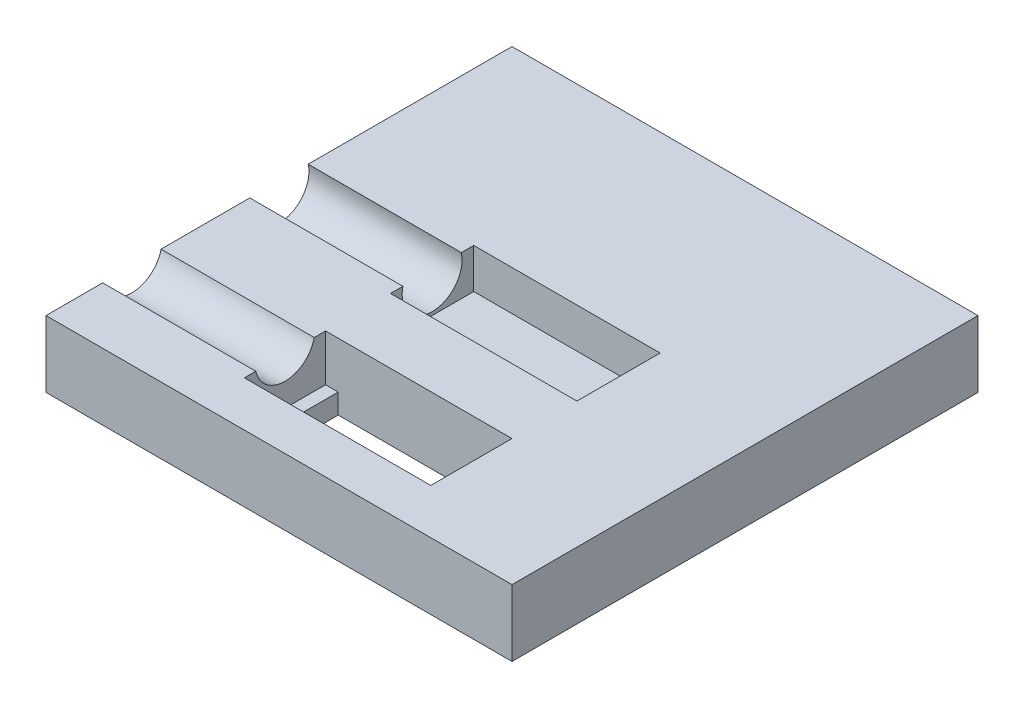
ISO-10303-21;
HEADER;
FILE_DESCRIPTION(('STEP AP214'),'2;1');
FILE_NAME('part.step','',(''),(''),'','','');
FILE_SCHEMA(('AUTOMOTIVE_DESIGN { 1 0 10303 214 1 1 1 1 }'));
ENDSEC;
DATA;
#1=APPLICATION_CONTEXT('core data for automotive mechanical design processes');
#2=APPLICATION_PROTOCOL_DEFINITION('international standard','automotive_design',2000,#1);
#3=PRODUCT_CONTEXT('',#1,'mechanical');
#4=PRODUCT('Part','Part','',(#3));
#5=PRODUCT_RELATED_PRODUCT_CATEGORY('part','',(#4));
#6=PRODUCT_DEFINITION_FORMATION('','',#4);
#7=PRODUCT_DEFINITION_CONTEXT('part definition',#1,'design');
#8=PRODUCT_DEFINITION('design','',#6,#7);
#9=PRODUCT_DEFINITION_SHAPE('','',#8);
#10=(LENGTH_UNIT() NAMED_UNIT(*) SI_UNIT(.MILLI.,.METRE.));
#11=(NAMED_UNIT(*) PLANE_ANGLE_UNIT() SI_UNIT($,.RADIAN.));
#12=(NAMED_UNIT(*) SI_UNIT($,.STERADIAN.) SOLID_ANGLE_UNIT());
#13=UNCERTAINTY_MEASURE_WITH_UNIT(LENGTH_MEASURE(1.E-05),#10,'distance_accuracy_value','');
#14=(GEOMETRIC_REPRESENTATION_CONTEXT(3) GLOBAL_UNCERTAINTY_ASSIGNED_CONTEXT((#13)) GLOBAL_UNIT_ASSIGNED_CONTEXT((#10,
#11,#12)) REPRESENTATION_CONTEXT('',''));
#15=CARTESIAN_POINT('',(0.,0.,0.));
#16=DIRECTION('',(0.,0.,1.));
#17=DIRECTION('',(1.,0.,0.));
#18=AXIS2_PLACEMENT_3D('',#15,#16,#17);
#19=CARTESIAN_POINT('',(-35.001,46.,22.1));
#20=DIRECTION('',(1.,0.,0.));
#21=DIRECTION('',(0.,0.,-1.));
#22=AXIS2_PLACEMENT_3D('',#19,#20,#21);
#23=CYLINDRICAL_SURFACE('',#22,4.50000000000001);
#24=CARTESIAN_POINT('',(-12.,46.,22.1));
#25=DIRECTION('',(1.,0.,0.));
#26=DIRECTION('',(0.,0.,-1.));
#27=AXIS2_PLACEMENT_3D('',#24,#25,#26);
#28=CIRCLE('',#27,4.50000000000001);
#29=CARTESIAN_POINT('',(-12.,45.0001693639848,17.7124792081079));
#30=VERTEX_POINT('',#29);
#31=CARTESIAN_POINT('',(-12.,45.0001693639848,26.4875207918921));
#32=VERTEX_POINT('',#31);
#33=EDGE_CURVE('E190',#30,#32,#28,.F.);
#34=ORIENTED_EDGE('',*,*,#33,.F.);
#35=DIRECTION('',(1.,0.,0.));
#36=VECTOR('',#35,1.);
#37=CARTESIAN_POINT('',(-35.001,45.0001693639848,17.7124792081079));
#38=LINE('',#37,#36);
#39=CARTESIAN_POINT('',(-35.,45.0001693639848,17.7124792081079));
#40=VERTEX_POINT('',#39);
#41=EDGE_CURVE('E65',#40,#30,#38,.T.);
#42=ORIENTED_EDGE('',*,*,#41,.F.);
#43=CARTESIAN_POINT('',(-35.,46.,22.1));
#44=DIRECTION('',(1.,0.,0.));
#45=DIRECTION('',(0.,0.,-1.));
#46=AXIS2_PLACEMENT_3D('',#43,#44,#45);
#47=CIRCLE('',#46,4.50000000000001);
#48=CARTESIAN_POINT('',(-35.,45.0001693639848,26.4875207918921));
#49=VERTEX_POINT('',#48);
#50=EDGE_CURVE('E255',#40,#49,#47,.F.);
#51=ORIENTED_EDGE('',*,*,#50,.T.);
#52=DIRECTION('',(1.,0.,0.));
#53=VECTOR('',#52,1.);
#54=CARTESIAN_POINT('',(-35.001,45.0001693639848,26.4875207918921));
#55=LINE('',#54,#53);
#56=EDGE_CURVE('E358',#32,#49,#55,.F.);
#57=ORIENTED_EDGE('',*,*,#56,.F.);
#58=EDGE_LOOP('',(#34,#42,#51,#57));
#59=FACE_BOUND('',#58,.T.);
#60=ADVANCED_FACE('F41',(#59),#23,.F.);
#61=CARTESIAN_POINT('',(-35.001,44.,0.));
#62=DIRECTION('',(1.,0.,0.));
#63=DIRECTION('',(0.,0.,-1.));
#64=AXIS2_PLACEMENT_3D('',#61,#62,#63);
#65=CYLINDRICAL_SURFACE('',#64,4.5);
#66=CARTESIAN_POINT('',(-12.,44.,0.));
#67=DIRECTION('',(1.,0.,0.));
#68=DIRECTION('',(0.,0.,-1.));
#69=AXIS2_PLACEMENT_3D('',#66,#67,#68);
#70=CIRCLE('',#69,4.5);
#71=CARTESIAN_POINT('',(-12.,45.0001693639848,-4.38744358862267));
#72=VERTEX_POINT('',#71);
#73=CARTESIAN_POINT('',(-12.,45.0001693639848,4.38744358862267));
#74=VERTEX_POINT('',#73);
#75=EDGE_CURVE('E246',#72,#74,#70,.F.);
#76=ORIENTED_EDGE('',*,*,#75,.F.);
#77=DIRECTION('',(1.,0.,0.));
#78=VECTOR('',#77,1.);
#79=CARTESIAN_POINT('',(-35.001,45.0001693639848,-4.38744358862266));
#80=LINE('',#79,#78);
#81=CARTESIAN_POINT('',(-35.,45.0001693639848,-4.38744358862266));
#82=VERTEX_POINT('',#81);
#83=EDGE_CURVE('E313',#82,#72,#80,.T.);
#84=ORIENTED_EDGE('',*,*,#83,.F.);
#85=CARTESIAN_POINT('',(-35.,44.,0.));
#86=DIRECTION('',(1.,0.,0.));
#87=DIRECTION('',(0.,0.,-1.));
#88=AXIS2_PLACEMENT_3D('',#85,#86,#87);
#89=CIRCLE('',#88,4.5);
#90=CARTESIAN_POINT('',(-35.,45.0001693639848,4.38744358862267));
#91=VERTEX_POINT('',#90);
#92=EDGE_CURVE('E263',#82,#91,#89,.F.);
#93=ORIENTED_EDGE('',*,*,#92,.T.);
#94=DIRECTION('',(1.,0.,0.));
#95=VECTOR('',#94,1.);
#96=CARTESIAN_POINT('',(-35.001,45.0001693639848,4.38744358862267));
#97=LINE('',#96,#95);
#98=EDGE_CURVE('E315',#74,#91,#97,.F.);
#99=ORIENTED_EDGE('',*,*,#98,.F.);
#100=EDGE_LOOP('',(#76,#84,#93,#99));
#101=FACE_BOUND('',#100,.T.);
#102=ADVANCED_FACE('F312',(#101),#65,.F.);
#103=CARTESIAN_POINT('',(35.,64.,-35.));
#104=DIRECTION('',(-1.,0.,0.));
#105=DIRECTION('',(0.,0.,1.));
#106=AXIS2_PLACEMENT_3D('',#103,#104,#105);
#107=PLANE('',#106);
#108=DIRECTION('',(0.,-1.,0.));
#109=VECTOR('',#108,1.);
#110=CARTESIAN_POINT('',(35.,64.,-35.));
#111=LINE('',#110,#109);
#112=CARTESIAN_POINT('',(35.,45.0001693639848,-35.));
#113=VERTEX_POINT('',#112);
#114=CARTESIAN_POINT('',(35.,35.0001693639848,-35.));
#115=VERTEX_POINT('',#114);
#116=EDGE_CURVE('E50',#113,#115,#111,.T.);
#117=ORIENTED_EDGE('',*,*,#116,.F.);
#118=DIRECTION('',(0.,0.,-1.));
#119=VECTOR('',#118,1.);
#120=CARTESIAN_POINT('',(35.,45.0001693639848,0.));
#121=LINE('',#120,#119);
#122=CARTESIAN_POINT('',(35.,45.0001693639848,35.));
#123=VERTEX_POINT('',#122);
#124=EDGE_CURVE('E352',#123,#113,#121,.T.);
#125=ORIENTED_EDGE('',*,*,#124,.F.);
#126=DIRECTION('',(0.,-1.,0.));
#127=VECTOR('',#126,1.);
#128=CARTESIAN_POINT('',(35.,64.,35.));
#129=LINE('',#128,#127);
#130=CARTESIAN_POINT('',(35.,35.0001693639848,35.));
#131=VERTEX_POINT('',#130);
#132=EDGE_CURVE('E285',#123,#131,#129,.T.);
#133=ORIENTED_EDGE('',*,*,#132,.T.);
#134=DIRECTION('',(0.,0.,1.));
#135=VECTOR('',#134,1.);
#136=CARTESIAN_POINT('',(35.,35.0001693639848,35.));
#137=LINE('',#136,#135);
#138=EDGE_CURVE('E204',#115,#131,#137,.T.);
#139=ORIENTED_EDGE('',*,*,#138,.F.);
#140=EDGE_LOOP('',(#117,#125,#133,#139));
#141=FACE_BOUND('',#140,.T.);
#142=ADVANCED_FACE('F43',(#141),#107,.F.);
#143=CARTESIAN_POINT('',(-35.,64.,-35.));
#144=DIRECTION('',(0.,0.,1.));
#145=DIRECTION('',(1.,0.,0.));
#146=AXIS2_PLACEMENT_3D('',#143,#144,#145);
#147=PLANE('',#146);
#148=DIRECTION('',(0.,-1.,0.));
#149=VECTOR('',#148,1.);
#150=CARTESIAN_POINT('',(-35.,64.,-35.));
#151=LINE('',#150,#149);
#152=CARTESIAN_POINT('',(-35.,45.0001693639848,-35.));
#153=VERTEX_POINT('',#152);
#154=CARTESIAN_POINT('',(-35.,35.0001693639848,-35.));
#155=VERTEX_POINT('',#154);
#156=EDGE_CURVE('E294',#153,#155,#151,.T.);
#157=ORIENTED_EDGE('',*,*,#156,.F.);
#158=DIRECTION('',(-1.,0.,0.));
#159=VECTOR('',#158,1.);
#160=CARTESIAN_POINT('',(0.,45.0001693639848,-35.));
#161=LINE('',#160,#159);
#162=EDGE_CURVE('E351',#113,#153,#161,.T.);
#163=ORIENTED_EDGE('',*,*,#162,.F.);
#164=ORIENTED_EDGE('',*,*,#116,.T.);
#165=DIRECTION('',(1.,0.,0.));
#166=VECTOR('',#165,1.);
#167=CARTESIAN_POINT('',(-35.001,35.0001693639848,-35.));
#168=LINE('',#167,#166);
#169=EDGE_CURVE('E208',#155,#115,#168,.T.);
#170=ORIENTED_EDGE('',*,*,#169,.F.);
#171=EDGE_LOOP('',(#157,#163,#164,#170));
#172=FACE_BOUND('',#171,.T.);
#173=ADVANCED_FACE('F402',(#172),#147,.F.);
#174=CARTESIAN_POINT('',(-35.,64.,-35.));
#175=DIRECTION('',(1.,0.,0.));
#176=DIRECTION('',(0.,0.,-1.));
#177=AXIS2_PLACEMENT_3D('',#174,#175,#176);
#178=PLANE('',#177);
#179=DIRECTION('',(0.,-1.,0.));
#180=VECTOR('',#179,1.);
#181=CARTESIAN_POINT('',(-35.,64.,35.));
#182=LINE('',#181,#180);
#183=CARTESIAN_POINT('',(-35.,45.0001693639848,35.));
#184=VERTEX_POINT('',#183);
#185=CARTESIAN_POINT('',(-35.,35.0001693639848,35.));
#186=VERTEX_POINT('',#185);
#187=EDGE_CURVE('E291',#184,#186,#182,.T.);
#188=ORIENTED_EDGE('',*,*,#187,.F.);
#189=DIRECTION('',(0.,0.,1.));
#190=VECTOR('',#189,1.);
#191=CARTESIAN_POINT('',(-35.,45.0001693639848,0.));
#192=LINE('',#191,#190);
#193=EDGE_CURVE('E325',#49,#184,#192,.T.);
#194=ORIENTED_EDGE('',*,*,#193,.F.);
#195=ORIENTED_EDGE('',*,*,#50,.F.);
#196=EDGE_CURVE('E323',#91,#40,#192,.T.);
#197=ORIENTED_EDGE('',*,*,#196,.F.);
#198=ORIENTED_EDGE('',*,*,#92,.F.);
#199=EDGE_CURVE('E318',#153,#82,#192,.T.);
#200=ORIENTED_EDGE('',*,*,#199,.F.);
#201=ORIENTED_EDGE('',*,*,#156,.T.);
#202=DIRECTION('',(0.,0.,-1.));
#203=VECTOR('',#202,1.);
#204=CARTESIAN_POINT('',(-35.,35.0001693639848,35.));
#205=LINE('',#204,#203);
#206=EDGE_CURVE('E195',#186,#155,#205,.T.);
#207=ORIENTED_EDGE('',*,*,#206,.F.);
#208=EDGE_LOOP('',(#188,#194,#195,#197,#198,#200,#201,#207));
#209=FACE_BOUND('',#208,.T.);
#210=ADVANCED_FACE('F385',(#209),#178,.F.);
#211=CARTESIAN_POINT('',(-35.,64.,35.));
#212=DIRECTION('',(0.,0.,-1.));
#213=DIRECTION('',(-1.,0.,0.));
#214=AXIS2_PLACEMENT_3D('',#211,#212,#213);
#215=PLANE('',#214);
#216=ORIENTED_EDGE('',*,*,#132,.F.);
#217=DIRECTION('',(1.,0.,0.));
#218=VECTOR('',#217,1.);
#219=CARTESIAN_POINT('',(0.,45.0001693639848,35.));
#220=LINE('',#219,#218);
#221=EDGE_CURVE('E373',#184,#123,#220,.T.);
#222=ORIENTED_EDGE('',*,*,#221,.F.);
#223=ORIENTED_EDGE('',*,*,#187,.T.);
#224=DIRECTION('',(1.,0.,0.));
#225=VECTOR('',#224,1.);
#226=CARTESIAN_POINT('',(-35.001,35.0001693639848,35.));
#227=LINE('',#226,#225);
#228=EDGE_CURVE('E209',#186,#131,#227,.T.);
#229=ORIENTED_EDGE('',*,*,#228,.T.);
#230=EDGE_LOOP('',(#216,#222,#223,#229));
#231=FACE_BOUND('',#230,.T.);
#232=ADVANCED_FACE('F391',(#231),#215,.F.);
#233=CARTESIAN_POINT('',(16.,39.,6.));
#234=DIRECTION('',(1.,0.,0.));
#235=DIRECTION('',(0.,0.,-1.));
#236=AXIS2_PLACEMENT_3D('',#233,#234,#235);
#237=PLANE('',#236);
#238=DIRECTION('',(0.,1.,0.));
#239=VECTOR('',#238,1.);
#240=CARTESIAN_POINT('',(16.,39.,6.25));
#241=LINE('',#240,#239);
#242=CARTESIAN_POINT('',(16.,39.,6.25));
#243=VERTEX_POINT('',#242);
#244=CARTESIAN_POINT('',(16.,45.0001693639848,6.25));
#245=VERTEX_POINT('',#244);
#246=EDGE_CURVE('E281',#243,#245,#241,.T.);
#247=ORIENTED_EDGE('',*,*,#246,.T.);
#248=DIRECTION('',(0.,0.,1.));
#249=VECTOR('',#248,1.);
#250=CARTESIAN_POINT('',(16.,45.0001693639848,0.));
#251=LINE('',#250,#249);
#252=CARTESIAN_POINT('',(16.,45.0001693639848,-6.25));
#253=VERTEX_POINT('',#252);
#254=EDGE_CURVE('E337',#253,#245,#251,.T.);
#255=ORIENTED_EDGE('',*,*,#254,.F.);
#256=DIRECTION('',(0.,1.,0.));
#257=VECTOR('',#256,1.);
#258=CARTESIAN_POINT('',(16.,39.,-6.25));
#259=LINE('',#258,#257);
#260=CARTESIAN_POINT('',(16.,39.,-6.25));
#261=VERTEX_POINT('',#260);
#262=EDGE_CURVE('E280',#261,#253,#259,.T.);
#263=ORIENTED_EDGE('',*,*,#262,.F.);
#264=DIRECTION('',(0.,0.,-1.));
#265=VECTOR('',#264,1.);
#266=CARTESIAN_POINT('',(16.,39.,-6.25));
#267=LINE('',#266,#265);
#268=EDGE_CURVE('E269',#243,#261,#267,.T.);
#269=ORIENTED_EDGE('',*,*,#268,.F.);
#270=EDGE_LOOP('',(#247,#255,#263,#269));
#271=FACE_BOUND('',#270,.T.);
#272=ADVANCED_FACE('F416',(#271),#237,.F.);
#273=CARTESIAN_POINT('',(16.,39.,6.25));
#274=DIRECTION('',(0.,0.,1.));
#275=DIRECTION('',(1.,0.,0.));
#276=AXIS2_PLACEMENT_3D('',#273,#274,#275);
#277=PLANE('',#276);
#278=DIRECTION('',(0.,-1.,0.));
#279=VECTOR('',#278,1.);
#280=CARTESIAN_POINT('',(-12.,51.9986853970522,6.25));
#281=LINE('',#280,#279);
#282=CARTESIAN_POINT('',(-12.,45.0001693639848,6.25));
#283=VERTEX_POINT('',#282);
#284=CARTESIAN_POINT('',(-12.,39.,6.25));
#285=VERTEX_POINT('',#284);
#286=EDGE_CURVE('E239',#283,#285,#281,.T.);
#287=ORIENTED_EDGE('',*,*,#286,.F.);
#288=DIRECTION('',(-1.,0.,0.));
#289=VECTOR('',#288,1.);
#290=CARTESIAN_POINT('',(0.,45.0001693639848,6.25));
#291=LINE('',#290,#289);
#292=EDGE_CURVE('E334',#245,#283,#291,.T.);
#293=ORIENTED_EDGE('',*,*,#292,.F.);
#294=ORIENTED_EDGE('',*,*,#246,.F.);
#295=DIRECTION('',(1.,0.,0.));
#296=VECTOR('',#295,1.);
#297=CARTESIAN_POINT('',(16.,39.,6.25));
#298=LINE('',#297,#296);
#299=EDGE_CURVE('E276',#285,#243,#298,.T.);
#300=ORIENTED_EDGE('',*,*,#299,.F.);
#301=EDGE_LOOP('',(#287,#293,#294,#300));
#302=FACE_BOUND('',#301,.T.);
#303=ADVANCED_FACE('F419',(#302),#277,.F.);
#304=CARTESIAN_POINT('',(-7.,39.,-6.25));
#305=DIRECTION('',(0.,0.,-1.));
#306=DIRECTION('',(-1.,0.,0.));
#307=AXIS2_PLACEMENT_3D('',#304,#305,#306);
#308=PLANE('',#307);
#309=ORIENTED_EDGE('',*,*,#262,.T.);
#310=DIRECTION('',(1.,0.,0.));
#311=VECTOR('',#310,1.);
#312=CARTESIAN_POINT('',(0.,45.0001693639848,-6.25));
#313=LINE('',#312,#311);
#314=CARTESIAN_POINT('',(-12.,45.0001693639848,-6.25));
#315=VERTEX_POINT('',#314);
#316=EDGE_CURVE('E331',#315,#253,#313,.T.);
#317=ORIENTED_EDGE('',*,*,#316,.F.);
#318=DIRECTION('',(0.,1.,0.));
#319=VECTOR('',#318,1.);
#320=CARTESIAN_POINT('',(-12.,39.,-6.25));
#321=LINE('',#320,#319);
#322=CARTESIAN_POINT('',(-12.,39.,-6.25));
#323=VERTEX_POINT('',#322);
#324=EDGE_CURVE('E235',#323,#315,#321,.T.);
#325=ORIENTED_EDGE('',*,*,#324,.F.);
#326=DIRECTION('',(-1.,0.,0.));
#327=VECTOR('',#326,1.);
#328=CARTESIAN_POINT('',(-7.,39.,-6.25));
#329=LINE('',#328,#327);
#330=EDGE_CURVE('E273',#261,#323,#329,.T.);
#331=ORIENTED_EDGE('',*,*,#330,.F.);
#332=EDGE_LOOP('',(#309,#317,#325,#331));
#333=FACE_BOUND('',#332,.T.);
#334=ADVANCED_FACE('F408',(#333),#308,.F.);
#335=CARTESIAN_POINT('',(0.,39.,0.));
#336=DIRECTION('',(0.,-1.,0.));
#337=DIRECTION('',(0.,0.,-1.));
#338=AXIS2_PLACEMENT_3D('',#335,#336,#337);
#339=PLANE('',#338);
#340=ORIENTED_EDGE('',*,*,#268,.T.);
#341=ORIENTED_EDGE('',*,*,#330,.T.);
#342=DIRECTION('',(0.,0.,-1.));
#343=VECTOR('',#342,1.);
#344=CARTESIAN_POINT('',(-12.,39.,6.25));
#345=LINE('',#344,#343);
#346=EDGE_CURVE('E242',#285,#323,#345,.T.);
#347=ORIENTED_EDGE('',*,*,#346,.F.);
#348=ORIENTED_EDGE('',*,*,#299,.T.);
#349=EDGE_LOOP('',(#340,#341,#347,#348));
#350=FACE_BOUND('',#349,.T.);
#351=ADVANCED_FACE('F413',(#350),#339,.F.);
#352=CARTESIAN_POINT('',(-7.,51.,28.2));
#353=DIRECTION('',(0.,0.,1.));
#354=DIRECTION('',(1.,0.,0.));
#355=AXIS2_PLACEMENT_3D('',#352,#353,#354);
#356=PLANE('',#355);
#357=DIRECTION('',(1.,0.,0.));
#358=VECTOR('',#357,1.);
#359=CARTESIAN_POINT('',(-35.001,35.0001693639848,28.2));
#360=LINE('',#359,#358);
#361=CARTESIAN_POINT('',(-10.1,35.0001693639848,28.2));
#362=VERTEX_POINT('',#361);
#363=CARTESIAN_POINT('',(16.,35.0001693639848,28.2));
#364=VERTEX_POINT('',#363);
#365=EDGE_CURVE('E231',#362,#364,#360,.T.);
#366=ORIENTED_EDGE('',*,*,#365,.F.);
#367=DIRECTION('',(0.,1.,0.));
#368=VECTOR('',#367,1.);
#369=CARTESIAN_POINT('',(-10.1,34.9991693639848,28.2));
#370=LINE('',#369,#368);
#371=CARTESIAN_POINT('',(-10.1,38.0001693639849,28.2));
#372=VERTEX_POINT('',#371);
#373=EDGE_CURVE('E57',#362,#372,#370,.T.);
#374=ORIENTED_EDGE('',*,*,#373,.T.);
#375=DIRECTION('',(1.,0.,0.));
#376=VECTOR('',#375,1.);
#377=CARTESIAN_POINT('',(-12.,38.0001693639849,28.2));
#378=LINE('',#377,#376);
#379=CARTESIAN_POINT('',(-12.,38.0001693639849,28.2));
#380=VERTEX_POINT('',#379);
#381=EDGE_CURVE('E173',#380,#372,#378,.T.);
#382=ORIENTED_EDGE('',*,*,#381,.F.);
#383=DIRECTION('',(0.,-1.,0.));
#384=VECTOR('',#383,1.);
#385=CARTESIAN_POINT('',(-12.,51.,28.2));
#386=LINE('',#385,#384);
#387=CARTESIAN_POINT('',(-12.,45.0001693639848,28.2));
#388=VERTEX_POINT('',#387);
#389=EDGE_CURVE('E341',#388,#380,#386,.T.);
#390=ORIENTED_EDGE('',*,*,#389,.F.);
#391=DIRECTION('',(-1.,0.,0.));
#392=VECTOR('',#391,1.);
#393=CARTESIAN_POINT('',(0.,45.0001693639848,28.2));
#394=LINE('',#393,#392);
#395=CARTESIAN_POINT('',(16.,45.0001693639848,28.2));
#396=VERTEX_POINT('',#395);
#397=EDGE_CURVE('E362',#396,#388,#394,.T.);
#398=ORIENTED_EDGE('',*,*,#397,.F.);
#399=DIRECTION('',(0.,-1.,0.));
#400=VECTOR('',#399,1.);
#401=CARTESIAN_POINT('',(16.,51.,28.2));
#402=LINE('',#401,#400);
#403=EDGE_CURVE('E260',#396,#364,#402,.T.);
#404=ORIENTED_EDGE('',*,*,#403,.T.);
#405=EDGE_LOOP('',(#366,#374,#382,#390,#398,#404));
#406=FACE_BOUND('',#405,.T.);
#407=ADVANCED_FACE('F441',(#406),#356,.F.);
#408=CARTESIAN_POINT('',(16.,51.,16.));
#409=DIRECTION('',(1.,0.,0.));
#410=DIRECTION('',(0.,0.,-1.));
#411=AXIS2_PLACEMENT_3D('',#408,#409,#410);
#412=PLANE('',#411);
#413=ORIENTED_EDGE('',*,*,#403,.F.);
#414=DIRECTION('',(0.,0.,1.));
#415=VECTOR('',#414,1.);
#416=CARTESIAN_POINT('',(16.,45.0001693639848,0.));
#417=LINE('',#416,#415);
#418=CARTESIAN_POINT('',(16.,45.0001693639848,16.));
#419=VERTEX_POINT('',#418);
#420=EDGE_CURVE('E361',#419,#396,#417,.T.);
#421=ORIENTED_EDGE('',*,*,#420,.F.);
#422=DIRECTION('',(0.,-1.,0.));
#423=VECTOR('',#422,1.);
#424=CARTESIAN_POINT('',(16.,51.,16.));
#425=LINE('',#424,#423);
#426=CARTESIAN_POINT('',(16.,35.0001693639848,16.));
#427=VERTEX_POINT('',#426);
#428=EDGE_CURVE('E259',#419,#427,#425,.T.);
#429=ORIENTED_EDGE('',*,*,#428,.T.);
#430=DIRECTION('',(0.,0.,-1.));
#431=VECTOR('',#430,1.);
#432=CARTESIAN_POINT('',(16.,35.0001693639848,35.));
#433=LINE('',#432,#431);
#434=EDGE_CURVE('E227',#364,#427,#433,.T.);
#435=ORIENTED_EDGE('',*,*,#434,.F.);
#436=EDGE_LOOP('',(#413,#421,#429,#435));
#437=FACE_BOUND('',#436,.T.);
#438=ADVANCED_FACE('F438',(#437),#412,.F.);
#439=CARTESIAN_POINT('',(-7.,51.,16.));
#440=DIRECTION('',(0.,0.,-1.));
#441=DIRECTION('',(-1.,0.,0.));
#442=AXIS2_PLACEMENT_3D('',#439,#440,#441);
#443=PLANE('',#442);
#444=DIRECTION('',(0.,1.,0.));
#445=VECTOR('',#444,1.);
#446=CARTESIAN_POINT('',(-10.1,34.9991693639848,16.));
#447=LINE('',#446,#445);
#448=CARTESIAN_POINT('',(-10.1,35.0001693639848,16.));
#449=VERTEX_POINT('',#448);
#450=CARTESIAN_POINT('',(-10.1,38.0001693639849,16.));
#451=VERTEX_POINT('',#450);
#452=EDGE_CURVE('E177',#449,#451,#447,.T.);
#453=ORIENTED_EDGE('',*,*,#452,.F.);
#454=DIRECTION('',(-1.,0.,0.));
#455=VECTOR('',#454,1.);
#456=CARTESIAN_POINT('',(-35.001,35.0001693639848,16.));
#457=LINE('',#456,#455);
#458=EDGE_CURVE('E224',#427,#449,#457,.T.);
#459=ORIENTED_EDGE('',*,*,#458,.F.);
#460=ORIENTED_EDGE('',*,*,#428,.F.);
#461=DIRECTION('',(1.,0.,0.));
#462=VECTOR('',#461,1.);
#463=CARTESIAN_POINT('',(0.,45.0001693639848,16.));
#464=LINE('',#463,#462);
#465=CARTESIAN_POINT('',(-12.,45.0001693639848,16.));
#466=VERTEX_POINT('',#465);
#467=EDGE_CURVE('E370',#466,#419,#464,.T.);
#468=ORIENTED_EDGE('',*,*,#467,.F.);
#469=DIRECTION('',(0.,1.,0.));
#470=VECTOR('',#469,1.);
#471=CARTESIAN_POINT('',(-12.,51.,16.));
#472=LINE('',#471,#470);
#473=CARTESIAN_POINT('',(-12.,38.0001693639849,16.));
#474=VERTEX_POINT('',#473);
#475=EDGE_CURVE('E188',#474,#466,#472,.T.);
#476=ORIENTED_EDGE('',*,*,#475,.F.);
#477=DIRECTION('',(1.,0.,0.));
#478=VECTOR('',#477,1.);
#479=CARTESIAN_POINT('',(-12.,38.0001693639849,16.));
#480=LINE('',#479,#478);
#481=EDGE_CURVE('E171',#474,#451,#480,.T.);
#482=ORIENTED_EDGE('',*,*,#481,.T.);
#483=EDGE_LOOP('',(#453,#459,#460,#468,#476,#482));
#484=FACE_BOUND('',#483,.T.);
#485=ADVANCED_FACE('F185',(#484),#443,.F.);
#486=CARTESIAN_POINT('',(-12.,0.,0.));
#487=DIRECTION('',(1.,0.,0.));
#488=DIRECTION('',(0.,0.,-1.));
#489=AXIS2_PLACEMENT_3D('',#486,#487,#488);
#490=PLANE('',#489);
#491=DIRECTION('',(0.,0.,1.));
#492=VECTOR('',#491,1.);
#493=CARTESIAN_POINT('',(-12.,45.0001693639848,0.));
#494=LINE('',#493,#492);
#495=EDGE_CURVE('E306',#74,#283,#494,.T.);
#496=ORIENTED_EDGE('',*,*,#495,.T.);
#497=ORIENTED_EDGE('',*,*,#286,.T.);
#498=ORIENTED_EDGE('',*,*,#346,.T.);
#499=ORIENTED_EDGE('',*,*,#324,.T.);
#500=EDGE_CURVE('E308',#315,#72,#494,.T.);
#501=ORIENTED_EDGE('',*,*,#500,.T.);
#502=ORIENTED_EDGE('',*,*,#75,.T.);
#503=EDGE_LOOP('',(#496,#497,#498,#499,#501,#502));
#504=FACE_BOUND('',#503,.T.);
#505=ADVANCED_FACE('F305',(#504),#490,.T.);
#506=CARTESIAN_POINT('',(-35.001,35.0001693639848,35.));
#507=DIRECTION('',(0.,1.,0.));
#508=DIRECTION('',(0.,0.,1.));
#509=AXIS2_PLACEMENT_3D('',#506,#507,#508);
#510=PLANE('',#509);
#511=ORIENTED_EDGE('',*,*,#458,.T.);
#512=DIRECTION('',(0.,0.,1.));
#513=VECTOR('',#512,1.);
#514=CARTESIAN_POINT('',(-10.1,35.0001693639848,35.));
#515=LINE('',#514,#513);
#516=EDGE_CURVE('E180',#449,#362,#515,.T.);
#517=ORIENTED_EDGE('',*,*,#516,.T.);
#518=ORIENTED_EDGE('',*,*,#365,.T.);
#519=ORIENTED_EDGE('',*,*,#434,.T.);
#520=EDGE_LOOP('',(#511,#517,#518,#519));
#521=FACE_BOUND('',#520,.T.);
#522=ORIENTED_EDGE('',*,*,#206,.T.);
#523=ORIENTED_EDGE('',*,*,#169,.T.);
#524=ORIENTED_EDGE('',*,*,#138,.T.);
#525=ORIENTED_EDGE('',*,*,#228,.F.);
#526=EDGE_LOOP('',(#522,#523,#524,#525));
#527=FACE_BOUND('',#526,.T.);
#528=CARTESIAN_POINT('',(19.,35.0001693639848,22.1));
#529=DIRECTION('',(0.,1.,0.));
#530=DIRECTION('',(0.,0.,1.));
#531=AXIS2_PLACEMENT_3D('',#528,#529,#530);
#532=CIRCLE('',#531,1.1);
#533=CARTESIAN_POINT('',(19.,35.0001693639848,23.2));
#534=VERTEX_POINT('',#533);
#535=EDGE_CURVE('E220',#534,#534,#532,.T.);
#536=ORIENTED_EDGE('',*,*,#535,.T.);
#537=EDGE_LOOP('',(#536));
#538=FACE_BOUND('',#537,.T.);
#539=CARTESIAN_POINT('',(0.,35.0001693639848,-22.1));
#540=DIRECTION('',(0.,1.,0.));
#541=DIRECTION('',(0.,0.,1.));
#542=AXIS2_PLACEMENT_3D('',#539,#540,#541);
#543=CIRCLE('',#542,3.7);
#544=CARTESIAN_POINT('',(0.,35.0001693639848,-18.4));
#545=VERTEX_POINT('',#544);
#546=EDGE_CURVE('E213',#545,#545,#543,.T.);
#547=ORIENTED_EDGE('',*,*,#546,.T.);
#548=EDGE_LOOP('',(#547));
#549=FACE_BOUND('',#548,.T.);
#550=ADVANCED_FACE('F397',(#521,#527,#538,#549),#510,.F.);
#551=CARTESIAN_POINT('',(19.,40.,22.1));
#552=DIRECTION('',(0.,-1.,0.));
#553=DIRECTION('',(0.,0.,-1.));
#554=AXIS2_PLACEMENT_3D('',#551,#552,#553);
#555=PLANE('',#554);
#556=CARTESIAN_POINT('',(19.,40.,22.1));
#557=DIRECTION('',(0.,-1.,0.));
#558=DIRECTION('',(0.,0.,-1.));
#559=AXIS2_PLACEMENT_3D('',#556,#557,#558);
#560=CIRCLE('',#559,1.1);
#561=CARTESIAN_POINT('',(19.,40.,21.));
#562=VERTEX_POINT('',#561);
#563=EDGE_CURVE('E251',#562,#562,#560,.T.);
#564=ORIENTED_EDGE('',*,*,#563,.T.);
#565=EDGE_LOOP('',(#564));
#566=FACE_BOUND('',#565,.T.);
#567=ADVANCED_FACE('F480',(#566),#555,.T.);
#568=CARTESIAN_POINT('',(19.,40.,22.1));
#569=DIRECTION('',(0.,-1.,0.));
#570=DIRECTION('',(0.,0.,-1.));
#571=AXIS2_PLACEMENT_3D('',#568,#569,#570);
#572=CYLINDRICAL_SURFACE('',#571,1.1);
#573=ORIENTED_EDGE('',*,*,#535,.F.);
#574=EDGE_LOOP('',(#573));
#575=FACE_BOUND('',#574,.T.);
#576=ORIENTED_EDGE('',*,*,#563,.F.);
#577=EDGE_LOOP('',(#576));
#578=FACE_BOUND('',#577,.T.);
#579=ADVANCED_FACE('F436',(#575,#578),#572,.F.);
#580=CARTESIAN_POINT('',(0.,40.,-22.1));
#581=DIRECTION('',(0.,-1.,0.));
#582=DIRECTION('',(0.,0.,-1.));
#583=AXIS2_PLACEMENT_3D('',#580,#581,#582);
#584=PLANE('',#583);
#585=CARTESIAN_POINT('',(0.,40.,-22.1));
#586=DIRECTION('',(0.,-1.,0.));
#587=DIRECTION('',(0.,0.,-1.));
#588=AXIS2_PLACEMENT_3D('',#585,#586,#587);
#589=CIRCLE('',#588,3.7);
#590=CARTESIAN_POINT('',(0.,40.,-25.8));
#591=VERTEX_POINT('',#590);
#592=EDGE_CURVE('E247',#591,#591,#589,.T.);
#593=ORIENTED_EDGE('',*,*,#592,.T.);
#594=EDGE_LOOP('',(#593));
#595=FACE_BOUND('',#594,.T.);
#596=ADVANCED_FACE('F494',(#595),#584,.T.);
#597=CARTESIAN_POINT('',(0.,40.,-22.1));
#598=DIRECTION('',(0.,-1.,0.));
#599=DIRECTION('',(0.,0.,-1.));
#600=AXIS2_PLACEMENT_3D('',#597,#598,#599);
#601=CYLINDRICAL_SURFACE('',#600,3.7);
#602=ORIENTED_EDGE('',*,*,#546,.F.);
#603=EDGE_LOOP('',(#602));
#604=FACE_BOUND('',#603,.T.);
#605=ORIENTED_EDGE('',*,*,#592,.F.);
#606=EDGE_LOOP('',(#605));
#607=FACE_BOUND('',#606,.T.);
#608=ADVANCED_FACE('F501',(#604,#607),#601,.F.);
#609=CARTESIAN_POINT('',(-12.,0.,0.));
#610=DIRECTION('',(1.,0.,0.));
#611=DIRECTION('',(0.,0.,-1.));
#612=AXIS2_PLACEMENT_3D('',#609,#610,#611);
#613=PLANE('',#612);
#614=DIRECTION('',(0.,0.,1.));
#615=VECTOR('',#614,1.);
#616=CARTESIAN_POINT('',(-12.,45.0001693639848,0.));
#617=LINE('',#616,#615);
#618=EDGE_CURVE('E354',#32,#388,#617,.T.);
#619=ORIENTED_EDGE('',*,*,#618,.T.);
#620=ORIENTED_EDGE('',*,*,#389,.T.);
#621=DIRECTION('',(0.,0.,-1.));
#622=VECTOR('',#621,1.);
#623=CARTESIAN_POINT('',(-12.,38.0001693639849,22.1));
#624=LINE('',#623,#622);
#625=EDGE_CURVE('E196',#380,#474,#624,.T.);
#626=ORIENTED_EDGE('',*,*,#625,.T.);
#627=ORIENTED_EDGE('',*,*,#475,.T.);
#628=EDGE_CURVE('E348',#466,#30,#617,.T.);
#629=ORIENTED_EDGE('',*,*,#628,.T.);
#630=ORIENTED_EDGE('',*,*,#33,.T.);
#631=EDGE_LOOP('',(#619,#620,#626,#627,#629,#630));
#632=FACE_BOUND('',#631,.T.);
#633=ADVANCED_FACE('F347',(#632),#613,.T.);
#634=CARTESIAN_POINT('',(-12.,38.0001693639849,22.1));
#635=DIRECTION('',(0.,-1.,0.));
#636=DIRECTION('',(0.,0.,-1.));
#637=AXIS2_PLACEMENT_3D('',#634,#635,#636);
#638=PLANE('',#637);
#639=ORIENTED_EDGE('',*,*,#381,.T.);
#640=DIRECTION('',(0.,0.,-1.));
#641=VECTOR('',#640,1.);
#642=CARTESIAN_POINT('',(-10.1,38.0001693639849,22.1));
#643=LINE('',#642,#641);
#644=EDGE_CURVE('E11',#372,#451,#643,.T.);
#645=ORIENTED_EDGE('',*,*,#644,.T.);
#646=ORIENTED_EDGE('',*,*,#481,.F.);
#647=ORIENTED_EDGE('',*,*,#625,.F.);
#648=EDGE_LOOP('',(#639,#645,#646,#647));
#649=FACE_BOUND('',#648,.T.);
#650=ADVANCED_FACE('F168',(#649),#638,.F.);
#651=CARTESIAN_POINT('',(0.,45.0001693639848,0.));
#652=DIRECTION('',(0.,-1.,0.));
#653=DIRECTION('',(0.,0.,-1.));
#654=AXIS2_PLACEMENT_3D('',#651,#652,#653);
#655=PLANE('',#654);
#656=ORIENTED_EDGE('',*,*,#254,.T.);
#657=ORIENTED_EDGE('',*,*,#292,.T.);
#658=ORIENTED_EDGE('',*,*,#495,.F.);
#659=ORIENTED_EDGE('',*,*,#98,.T.);
#660=ORIENTED_EDGE('',*,*,#196,.T.);
#661=ORIENTED_EDGE('',*,*,#41,.T.);
#662=ORIENTED_EDGE('',*,*,#628,.F.);
#663=ORIENTED_EDGE('',*,*,#467,.T.);
#664=ORIENTED_EDGE('',*,*,#420,.T.);
#665=ORIENTED_EDGE('',*,*,#397,.T.);
#666=ORIENTED_EDGE('',*,*,#618,.F.);
#667=ORIENTED_EDGE('',*,*,#56,.T.);
#668=ORIENTED_EDGE('',*,*,#193,.T.);
#669=ORIENTED_EDGE('',*,*,#221,.T.);
#670=ORIENTED_EDGE('',*,*,#124,.T.);
#671=ORIENTED_EDGE('',*,*,#162,.T.);
#672=ORIENTED_EDGE('',*,*,#199,.T.);
#673=ORIENTED_EDGE('',*,*,#83,.T.);
#674=ORIENTED_EDGE('',*,*,#500,.F.);
#675=ORIENTED_EDGE('',*,*,#316,.T.);
#676=EDGE_LOOP('',(#656,#657,#658,#659,#660,#661,#662,#663,#664,#665,#666,#667,#668,#669,#670,
#671,#672,#673,#674,#675));
#677=FACE_BOUND('',#676,.T.);
#678=ADVANCED_FACE('F382',(#677),#655,.F.);
#679=CARTESIAN_POINT('',(-10.1,34.9991693639848,16.));
#680=DIRECTION('',(-1.,0.,0.));
#681=DIRECTION('',(0.,0.,1.));
#682=AXIS2_PLACEMENT_3D('',#679,#680,#681);
#683=PLANE('',#682);
#684=ORIENTED_EDGE('',*,*,#516,.F.);
#685=ORIENTED_EDGE('',*,*,#452,.T.);
#686=ORIENTED_EDGE('',*,*,#644,.F.);
#687=ORIENTED_EDGE('',*,*,#373,.F.);
#688=EDGE_LOOP('',(#684,#685,#686,#687));
#689=FACE_BOUND('',#688,.T.);
#690=ADVANCED_FACE('F178',(#689),#683,.F.);
#691=CLOSED_SHELL('',(#60,#102,#142,#173,#210,#232,#272,#303,#334,#351,#407,#438,#485,#505,#550,
#567,#579,#596,#608,#633,#650,#678,#690));
#692=MANIFOLD_SOLID_BREP('B2',#691);
#693=ADVANCED_BREP_SHAPE_REPRESENTATION('',(#18,#692),#14);
#694=SHAPE_DEFINITION_REPRESENTATION(#9,#693);
ENDSEC;
END-ISO-10303-21;
